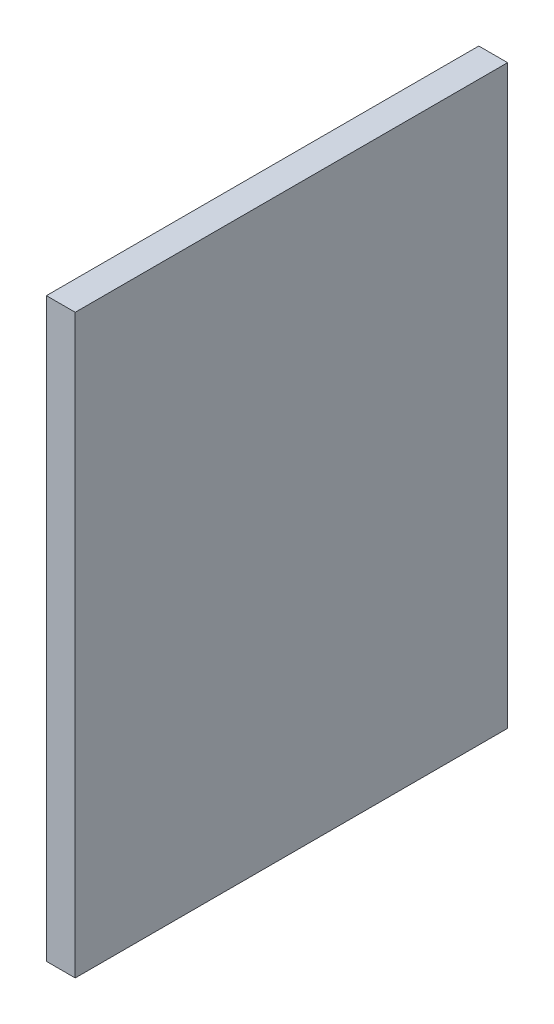
ISO-10303-21;
HEADER;
FILE_DESCRIPTION(('STEP AP214'),'2;1');
FILE_NAME('part.step','',(''),(''),'','','');
FILE_SCHEMA(('AUTOMOTIVE_DESIGN { 1 0 10303 214 1 1 1 1 }'));
ENDSEC;
DATA;
#1=APPLICATION_CONTEXT('core data for automotive mechanical design processes');
#2=APPLICATION_PROTOCOL_DEFINITION('international standard','automotive_design',2000,#1);
#3=PRODUCT_CONTEXT('',#1,'mechanical');
#4=PRODUCT('Part','Part','',(#3));
#5=PRODUCT_RELATED_PRODUCT_CATEGORY('part','',(#4));
#6=PRODUCT_DEFINITION_FORMATION('','',#4);
#7=PRODUCT_DEFINITION_CONTEXT('part definition',#1,'design');
#8=PRODUCT_DEFINITION('design','',#6,#7);
#9=PRODUCT_DEFINITION_SHAPE('','',#8);
#10=(LENGTH_UNIT() NAMED_UNIT(*) SI_UNIT(.MILLI.,.METRE.));
#11=(NAMED_UNIT(*) PLANE_ANGLE_UNIT() SI_UNIT($,.RADIAN.));
#12=(NAMED_UNIT(*) SI_UNIT($,.STERADIAN.) SOLID_ANGLE_UNIT());
#13=UNCERTAINTY_MEASURE_WITH_UNIT(LENGTH_MEASURE(1.E-05),#10,'distance_accuracy_value','');
#14=(GEOMETRIC_REPRESENTATION_CONTEXT(3) GLOBAL_UNCERTAINTY_ASSIGNED_CONTEXT((#13)) GLOBAL_UNIT_ASSIGNED_CONTEXT((#10,
#11,#12)) REPRESENTATION_CONTEXT('',''));
#15=CARTESIAN_POINT('',(0.,0.,0.));
#16=DIRECTION('',(0.,0.,1.));
#17=DIRECTION('',(1.,0.,0.));
#18=AXIS2_PLACEMENT_3D('',#15,#16,#17);
#19=CARTESIAN_POINT('',(60.,0.,0.));
#20=DIRECTION('',(0.,0.,-1.));
#21=DIRECTION('',(-1.,0.,0.));
#22=AXIS2_PLACEMENT_3D('',#19,#20,#21);
#23=PLANE('',#22);
#24=DIRECTION('',(0.,-1.,0.));
#25=VECTOR('',#24,1.);
#26=CARTESIAN_POINT('',(0.,0.,0.));
#27=LINE('',#26,#25);
#28=CARTESIAN_POINT('',(0.,1200.,0.));
#29=VERTEX_POINT('',#28);
#30=CARTESIAN_POINT('',(0.,0.,0.));
#31=VERTEX_POINT('',#30);
#32=EDGE_CURVE('E98',#29,#31,#27,.T.);
#33=ORIENTED_EDGE('',*,*,#32,.T.);
#34=DIRECTION('',(-1.,0.,0.));
#35=VECTOR('',#34,1.);
#36=CARTESIAN_POINT('',(60.,0.,0.));
#37=LINE('',#36,#35);
#38=CARTESIAN_POINT('',(60.,0.,0.));
#39=VERTEX_POINT('',#38);
#40=EDGE_CURVE('E11',#39,#31,#37,.T.);
#41=ORIENTED_EDGE('',*,*,#40,.F.);
#42=DIRECTION('',(0.,-1.,0.));
#43=VECTOR('',#42,1.);
#44=CARTESIAN_POINT('',(60.,0.,0.));
#45=LINE('',#44,#43);
#46=CARTESIAN_POINT('',(60.,1200.,0.));
#47=VERTEX_POINT('',#46);
#48=EDGE_CURVE('E86',#47,#39,#45,.T.);
#49=ORIENTED_EDGE('',*,*,#48,.F.);
#50=DIRECTION('',(-1.,0.,0.));
#51=VECTOR('',#50,1.);
#52=CARTESIAN_POINT('',(60.,1200.,0.));
#53=LINE('',#52,#51);
#54=EDGE_CURVE('E94',#47,#29,#53,.T.);
#55=ORIENTED_EDGE('',*,*,#54,.T.);
#56=EDGE_LOOP('',(#33,#41,#49,#55));
#57=FACE_BOUND('',#56,.T.);
#58=ADVANCED_FACE('F35',(#57),#23,.F.);
#59=CARTESIAN_POINT('',(60.,0.,0.));
#60=DIRECTION('',(0.,1.,0.));
#61=DIRECTION('',(0.,0.,1.));
#62=AXIS2_PLACEMENT_3D('',#59,#60,#61);
#63=PLANE('',#62);
#64=DIRECTION('',(0.,0.,-1.));
#65=VECTOR('',#64,1.);
#66=CARTESIAN_POINT('',(0.,0.,0.));
#67=LINE('',#66,#65);
#68=CARTESIAN_POINT('',(0.,0.,-900.));
#69=VERTEX_POINT('',#68);
#70=EDGE_CURVE('E90',#31,#69,#67,.T.);
#71=ORIENTED_EDGE('',*,*,#70,.T.);
#72=DIRECTION('',(-1.,0.,0.));
#73=VECTOR('',#72,1.);
#74=CARTESIAN_POINT('',(60.,0.,-900.));
#75=LINE('',#74,#73);
#76=CARTESIAN_POINT('',(60.,0.,-900.));
#77=VERTEX_POINT('',#76);
#78=EDGE_CURVE('E43',#77,#69,#75,.T.);
#79=ORIENTED_EDGE('',*,*,#78,.F.);
#80=DIRECTION('',(0.,0.,-1.));
#81=VECTOR('',#80,1.);
#82=CARTESIAN_POINT('',(60.,0.,0.));
#83=LINE('',#82,#81);
#84=EDGE_CURVE('E81',#39,#77,#83,.T.);
#85=ORIENTED_EDGE('',*,*,#84,.F.);
#86=ORIENTED_EDGE('',*,*,#40,.T.);
#87=EDGE_LOOP('',(#71,#79,#85,#86));
#88=FACE_BOUND('',#87,.T.);
#89=ADVANCED_FACE('F89',(#88),#63,.F.);
#90=CARTESIAN_POINT('',(60.,0.,-900.));
#91=DIRECTION('',(0.,0.,1.));
#92=DIRECTION('',(1.,0.,0.));
#93=AXIS2_PLACEMENT_3D('',#90,#91,#92);
#94=PLANE('',#93);
#95=DIRECTION('',(0.,1.,0.));
#96=VECTOR('',#95,1.);
#97=CARTESIAN_POINT('',(0.,0.,-900.));
#98=LINE('',#97,#96);
#99=CARTESIAN_POINT('',(0.,1200.,-900.));
#100=VERTEX_POINT('',#99);
#101=EDGE_CURVE('E68',#69,#100,#98,.T.);
#102=ORIENTED_EDGE('',*,*,#101,.T.);
#103=DIRECTION('',(-1.,0.,0.));
#104=VECTOR('',#103,1.);
#105=CARTESIAN_POINT('',(60.,1200.,-900.));
#106=LINE('',#105,#104);
#107=CARTESIAN_POINT('',(60.,1200.,-900.));
#108=VERTEX_POINT('',#107);
#109=EDGE_CURVE('E91',#108,#100,#106,.T.);
#110=ORIENTED_EDGE('',*,*,#109,.F.);
#111=DIRECTION('',(0.,1.,0.));
#112=VECTOR('',#111,1.);
#113=CARTESIAN_POINT('',(60.,0.,-900.));
#114=LINE('',#113,#112);
#115=EDGE_CURVE('E84',#77,#108,#114,.T.);
#116=ORIENTED_EDGE('',*,*,#115,.F.);
#117=ORIENTED_EDGE('',*,*,#78,.T.);
#118=EDGE_LOOP('',(#102,#110,#116,#117));
#119=FACE_BOUND('',#118,.T.);
#120=ADVANCED_FACE('F92',(#119),#94,.F.);
#121=CARTESIAN_POINT('',(60.,1200.,0.));
#122=DIRECTION('',(0.,-1.,0.));
#123=DIRECTION('',(0.,0.,-1.));
#124=AXIS2_PLACEMENT_3D('',#121,#122,#123);
#125=PLANE('',#124);
#126=DIRECTION('',(0.,0.,1.));
#127=VECTOR('',#126,1.);
#128=CARTESIAN_POINT('',(0.,1200.,0.));
#129=LINE('',#128,#127);
#130=EDGE_CURVE('E74',#100,#29,#129,.T.);
#131=ORIENTED_EDGE('',*,*,#130,.T.);
#132=ORIENTED_EDGE('',*,*,#54,.F.);
#133=DIRECTION('',(0.,0.,1.));
#134=VECTOR('',#133,1.);
#135=CARTESIAN_POINT('',(60.,1200.,0.));
#136=LINE('',#135,#134);
#137=EDGE_CURVE('E51',#108,#47,#136,.T.);
#138=ORIENTED_EDGE('',*,*,#137,.F.);
#139=ORIENTED_EDGE('',*,*,#109,.T.);
#140=EDGE_LOOP('',(#131,#132,#138,#139));
#141=FACE_BOUND('',#140,.T.);
#142=ADVANCED_FACE('F105',(#141),#125,.F.);
#143=CARTESIAN_POINT('',(60.,0.,0.));
#144=DIRECTION('',(-1.,0.,0.));
#145=DIRECTION('',(0.,0.,1.));
#146=AXIS2_PLACEMENT_3D('',#143,#144,#145);
#147=PLANE('',#146);
#148=ORIENTED_EDGE('',*,*,#48,.T.);
#149=ORIENTED_EDGE('',*,*,#84,.T.);
#150=ORIENTED_EDGE('',*,*,#115,.T.);
#151=ORIENTED_EDGE('',*,*,#137,.T.);
#152=EDGE_LOOP('',(#148,#149,#150,#151));
#153=FACE_BOUND('',#152,.T.);
#154=ADVANCED_FACE('F82',(#153),#147,.F.);
#155=CARTESIAN_POINT('',(0.,0.,0.));
#156=DIRECTION('',(-1.,0.,0.));
#157=DIRECTION('',(0.,0.,1.));
#158=AXIS2_PLACEMENT_3D('',#155,#156,#157);
#159=PLANE('',#158);
#160=ORIENTED_EDGE('',*,*,#32,.F.);
#161=ORIENTED_EDGE('',*,*,#130,.F.);
#162=ORIENTED_EDGE('',*,*,#101,.F.);
#163=ORIENTED_EDGE('',*,*,#70,.F.);
#164=EDGE_LOOP('',(#160,#161,#162,#163));
#165=FACE_BOUND('',#164,.T.);
#166=ADVANCED_FACE('F108',(#165),#159,.T.);
#167=CLOSED_SHELL('',(#58,#89,#120,#142,#154,#166));
#168=MANIFOLD_SOLID_BREP('B2',#167);
#169=ADVANCED_BREP_SHAPE_REPRESENTATION('',(#18,#168),#14);
#170=SHAPE_DEFINITION_REPRESENTATION(#9,#169);
ENDSEC;
END-ISO-10303-21;
